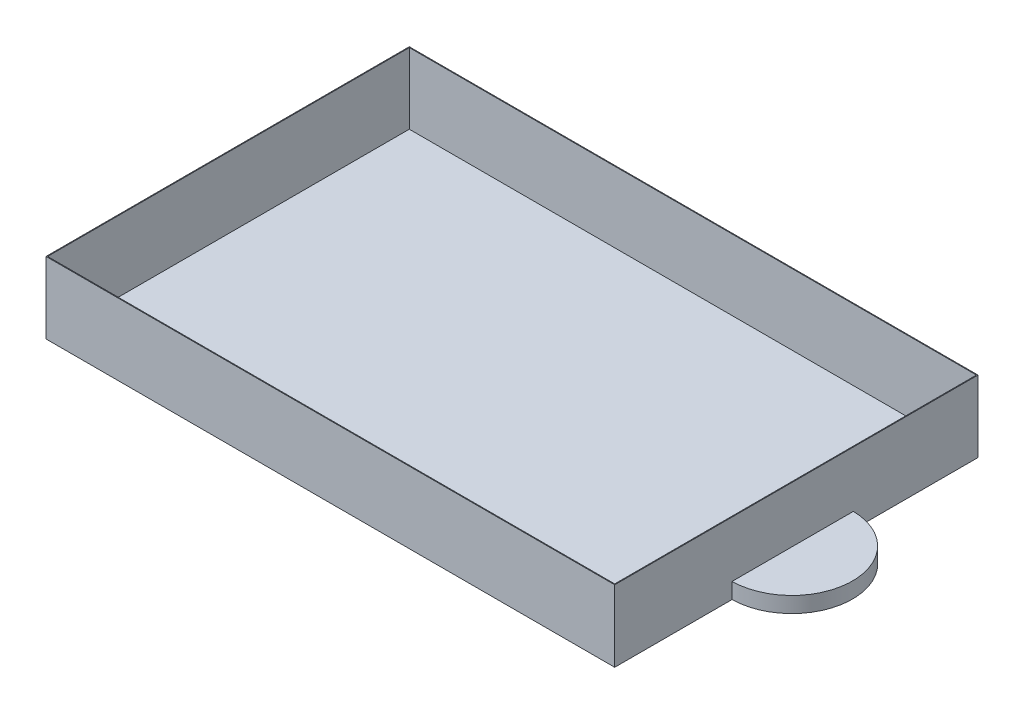
ISO-10303-21;
HEADER;
FILE_DESCRIPTION(('STEP AP214'),'2;1');
FILE_NAME('part.step','',(''),(''),'','','');
FILE_SCHEMA(('AUTOMOTIVE_DESIGN { 1 0 10303 214 1 1 1 1 }'));
ENDSEC;
DATA;
#1=APPLICATION_CONTEXT('core data for automotive mechanical design processes');
#2=APPLICATION_PROTOCOL_DEFINITION('international standard','automotive_design',2000,#1);
#3=PRODUCT_CONTEXT('',#1,'mechanical');
#4=PRODUCT('Part','Part','',(#3));
#5=PRODUCT_RELATED_PRODUCT_CATEGORY('part','',(#4));
#6=PRODUCT_DEFINITION_FORMATION('','',#4);
#7=PRODUCT_DEFINITION_CONTEXT('part definition',#1,'design');
#8=PRODUCT_DEFINITION('design','',#6,#7);
#9=PRODUCT_DEFINITION_SHAPE('','',#8);
#10=(LENGTH_UNIT() NAMED_UNIT(*) SI_UNIT(.MILLI.,.METRE.));
#11=(NAMED_UNIT(*) PLANE_ANGLE_UNIT() SI_UNIT($,.RADIAN.));
#12=(NAMED_UNIT(*) SI_UNIT($,.STERADIAN.) SOLID_ANGLE_UNIT());
#13=UNCERTAINTY_MEASURE_WITH_UNIT(LENGTH_MEASURE(1.E-05),#10,'distance_accuracy_value','');
#14=(GEOMETRIC_REPRESENTATION_CONTEXT(3) GLOBAL_UNCERTAINTY_ASSIGNED_CONTEXT((#13)) GLOBAL_UNIT_ASSIGNED_CONTEXT((#10,
#11,#12)) REPRESENTATION_CONTEXT('',''));
#15=CARTESIAN_POINT('',(0.,0.,0.));
#16=DIRECTION('',(0.,0.,1.));
#17=DIRECTION('',(1.,0.,0.));
#18=AXIS2_PLACEMENT_3D('',#15,#16,#17);
#19=CARTESIAN_POINT('',(72.4042738347161,9.1,0.));
#20=DIRECTION('',(-1.,0.,0.));
#21=DIRECTION('',(0.,0.,1.));
#22=AXIS2_PLACEMENT_3D('',#19,#20,#21);
#23=PLANE('',#22);
#24=DIRECTION('',(0.,-1.,0.));
#25=VECTOR('',#24,1.);
#26=CARTESIAN_POINT('',(72.4042738347161,2.,-30.3789905309977));
#27=LINE('',#26,#25);
#28=CARTESIAN_POINT('',(72.4042738347161,0.,-30.3789905309977));
#29=VERTEX_POINT('',#28);
#30=CARTESIAN_POINT('',(72.4042738347161,2.,-30.3789905309977));
#31=VERTEX_POINT('',#30);
#32=EDGE_CURVE('E131',#29,#31,#27,.F.);
#33=ORIENTED_EDGE('',*,*,#32,.F.);
#34=DIRECTION('',(0.,0.,-1.));
#35=VECTOR('',#34,1.);
#36=CARTESIAN_POINT('',(72.4042738347161,0.,0.));
#37=LINE('',#36,#35);
#38=CARTESIAN_POINT('',(72.4042738347161,0.,-46.2519188910528));
#39=VERTEX_POINT('',#38);
#40=EDGE_CURVE('E118',#29,#39,#37,.T.);
#41=ORIENTED_EDGE('',*,*,#40,.T.);
#42=DIRECTION('',(0.,-1.,0.));
#43=VECTOR('',#42,1.);
#44=CARTESIAN_POINT('',(72.4042738347161,9.1,-46.2519188910528));
#45=LINE('',#44,#43);
#46=CARTESIAN_POINT('',(72.4042738347161,9.1,-46.2519188910528));
#47=VERTEX_POINT('',#46);
#48=EDGE_CURVE('E216',#47,#39,#45,.T.);
#49=ORIENTED_EDGE('',*,*,#48,.F.);
#50=DIRECTION('',(0.,0.,-1.));
#51=VECTOR('',#50,1.);
#52=CARTESIAN_POINT('',(72.4042738347161,9.1,0.));
#53=LINE('',#52,#51);
#54=CARTESIAN_POINT('',(72.4042738347161,9.1,0.));
#55=VERTEX_POINT('',#54);
#56=EDGE_CURVE('E198',#55,#47,#53,.T.);
#57=ORIENTED_EDGE('',*,*,#56,.F.);
#58=DIRECTION('',(0.,-1.,0.));
#59=VECTOR('',#58,1.);
#60=CARTESIAN_POINT('',(72.4042738347161,9.1,0.));
#61=LINE('',#60,#59);
#62=CARTESIAN_POINT('',(72.4042738347161,0.,0.));
#63=VERTEX_POINT('',#62);
#64=EDGE_CURVE('E50',#55,#63,#61,.T.);
#65=ORIENTED_EDGE('',*,*,#64,.T.);
#66=CARTESIAN_POINT('',(72.4042738347161,0.,-14.937172772359));
#67=VERTEX_POINT('',#66);
#68=EDGE_CURVE('E128',#63,#67,#37,.T.);
#69=ORIENTED_EDGE('',*,*,#68,.T.);
#70=DIRECTION('',(0.,-1.,0.));
#71=VECTOR('',#70,1.);
#72=CARTESIAN_POINT('',(72.4042738347161,2.,-14.937172772359));
#73=LINE('',#72,#71);
#74=CARTESIAN_POINT('',(72.4042738347161,2.,-14.937172772359));
#75=VERTEX_POINT('',#74);
#76=EDGE_CURVE('E57',#75,#67,#73,.T.);
#77=ORIENTED_EDGE('',*,*,#76,.F.);
#78=DIRECTION('',(0.,0.,1.));
#79=VECTOR('',#78,1.);
#80=CARTESIAN_POINT('',(72.4042738347161,2.,0.));
#81=LINE('',#80,#79);
#82=EDGE_CURVE('E61',#31,#75,#81,.T.);
#83=ORIENTED_EDGE('',*,*,#82,.F.);
#84=EDGE_LOOP('',(#33,#41,#49,#57,#65,#69,#77,#83));
#85=FACE_BOUND('',#84,.T.);
#86=ADVANCED_FACE('F41',(#85),#23,.F.);
#87=CARTESIAN_POINT('',(0.,9.1,0.));
#88=DIRECTION('',(0.,-1.,0.));
#89=DIRECTION('',(0.,0.,-1.));
#90=AXIS2_PLACEMENT_3D('',#87,#88,#89);
#91=PLANE('',#90);
#92=DIRECTION('',(0.,0.,1.));
#93=VECTOR('',#92,1.);
#94=CARTESIAN_POINT('',(0.,9.1,0.));
#95=LINE('',#94,#93);
#96=CARTESIAN_POINT('',(0.,9.1,-46.2519188910528));
#97=VERTEX_POINT('',#96);
#98=CARTESIAN_POINT('',(0.,9.1,0.));
#99=VERTEX_POINT('',#98);
#100=EDGE_CURVE('E191',#97,#99,#95,.T.);
#101=ORIENTED_EDGE('',*,*,#100,.T.);
#102=DIRECTION('',(1.,0.,0.));
#103=VECTOR('',#102,1.);
#104=CARTESIAN_POINT('',(0.,9.1,0.));
#105=LINE('',#104,#103);
#106=EDGE_CURVE('E195',#99,#55,#105,.T.);
#107=ORIENTED_EDGE('',*,*,#106,.T.);
#108=ORIENTED_EDGE('',*,*,#56,.T.);
#109=DIRECTION('',(-1.,0.,0.));
#110=VECTOR('',#109,1.);
#111=CARTESIAN_POINT('',(0.,9.1,-46.2519188910528));
#112=LINE('',#111,#110);
#113=EDGE_CURVE('E201',#47,#97,#112,.T.);
#114=ORIENTED_EDGE('',*,*,#113,.T.);
#115=EDGE_LOOP('',(#101,#107,#108,#114));
#116=FACE_BOUND('',#115,.T.);
#117=DIRECTION('',(0.,0.,1.));
#118=VECTOR('',#117,1.);
#119=CARTESIAN_POINT('',(0.1,9.1,0.));
#120=LINE('',#119,#118);
#121=CARTESIAN_POINT('',(0.1,9.1,-46.1519188910528));
#122=VERTEX_POINT('',#121);
#123=CARTESIAN_POINT('',(0.1,9.1,-0.1));
#124=VERTEX_POINT('',#123);
#125=EDGE_CURVE('E179',#122,#124,#120,.T.);
#126=ORIENTED_EDGE('',*,*,#125,.F.);
#127=DIRECTION('',(-1.,0.,0.));
#128=VECTOR('',#127,1.);
#129=CARTESIAN_POINT('',(0.,9.1,-46.1519188910528));
#130=LINE('',#129,#128);
#131=CARTESIAN_POINT('',(72.3042738347161,9.1,-46.1519188910528));
#132=VERTEX_POINT('',#131);
#133=EDGE_CURVE('E164',#132,#122,#130,.T.);
#134=ORIENTED_EDGE('',*,*,#133,.F.);
#135=DIRECTION('',(0.,0.,-1.));
#136=VECTOR('',#135,1.);
#137=CARTESIAN_POINT('',(72.3042738347161,9.1,0.));
#138=LINE('',#137,#136);
#139=CARTESIAN_POINT('',(72.3042738347161,9.1,-0.1));
#140=VERTEX_POINT('',#139);
#141=EDGE_CURVE('E185',#140,#132,#138,.T.);
#142=ORIENTED_EDGE('',*,*,#141,.F.);
#143=DIRECTION('',(1.,0.,0.));
#144=VECTOR('',#143,1.);
#145=CARTESIAN_POINT('',(0.,9.1,-0.1));
#146=LINE('',#145,#144);
#147=EDGE_CURVE('E182',#124,#140,#146,.T.);
#148=ORIENTED_EDGE('',*,*,#147,.F.);
#149=EDGE_LOOP('',(#126,#134,#142,#148));
#150=FACE_BOUND('',#149,.T.);
#151=ADVANCED_FACE('F232',(#116,#150),#91,.F.);
#152=CARTESIAN_POINT('',(0.,9.1,0.));
#153=DIRECTION('',(1.,0.,0.));
#154=DIRECTION('',(0.,0.,-1.));
#155=AXIS2_PLACEMENT_3D('',#152,#153,#154);
#156=PLANE('',#155);
#157=DIRECTION('',(0.,0.,1.));
#158=VECTOR('',#157,1.);
#159=CARTESIAN_POINT('',(0.,0.,0.));
#160=LINE('',#159,#158);
#161=CARTESIAN_POINT('',(0.,0.,-46.2519188910528));
#162=VERTEX_POINT('',#161);
#163=CARTESIAN_POINT('',(0.,0.,0.));
#164=VERTEX_POINT('',#163);
#165=EDGE_CURVE('E157',#162,#164,#160,.T.);
#166=ORIENTED_EDGE('',*,*,#165,.T.);
#167=DIRECTION('',(0.,-1.,0.));
#168=VECTOR('',#167,1.);
#169=CARTESIAN_POINT('',(0.,9.1,0.));
#170=LINE('',#169,#168);
#171=EDGE_CURVE('E11',#99,#164,#170,.T.);
#172=ORIENTED_EDGE('',*,*,#171,.F.);
#173=ORIENTED_EDGE('',*,*,#100,.F.);
#174=DIRECTION('',(0.,-1.,0.));
#175=VECTOR('',#174,1.);
#176=CARTESIAN_POINT('',(0.,9.1,-46.2519188910528));
#177=LINE('',#176,#175);
#178=EDGE_CURVE('E204',#97,#162,#177,.T.);
#179=ORIENTED_EDGE('',*,*,#178,.T.);
#180=EDGE_LOOP('',(#166,#172,#173,#179));
#181=FACE_BOUND('',#180,.T.);
#182=ADVANCED_FACE('F43',(#181),#156,.F.);
#183=CARTESIAN_POINT('',(0.,9.1,0.));
#184=DIRECTION('',(0.,0.,-1.));
#185=DIRECTION('',(-1.,0.,0.));
#186=AXIS2_PLACEMENT_3D('',#183,#184,#185);
#187=PLANE('',#186);
#188=DIRECTION('',(1.,0.,0.));
#189=VECTOR('',#188,1.);
#190=CARTESIAN_POINT('',(0.,0.,0.));
#191=LINE('',#190,#189);
#192=EDGE_CURVE('E129',#164,#63,#191,.T.);
#193=ORIENTED_EDGE('',*,*,#192,.T.);
#194=ORIENTED_EDGE('',*,*,#64,.F.);
#195=ORIENTED_EDGE('',*,*,#106,.F.);
#196=ORIENTED_EDGE('',*,*,#171,.T.);
#197=EDGE_LOOP('',(#193,#194,#195,#196));
#198=FACE_BOUND('',#197,.T.);
#199=ADVANCED_FACE('F224',(#198),#187,.F.);
#200=CARTESIAN_POINT('',(0.,9.1,-46.2519188910528));
#201=DIRECTION('',(0.,0.,1.));
#202=DIRECTION('',(1.,0.,0.));
#203=AXIS2_PLACEMENT_3D('',#200,#201,#202);
#204=PLANE('',#203);
#205=DIRECTION('',(-1.,0.,0.));
#206=VECTOR('',#205,1.);
#207=CARTESIAN_POINT('',(0.,0.,-46.2519188910528));
#208=LINE('',#207,#206);
#209=EDGE_CURVE('E124',#39,#162,#208,.T.);
#210=ORIENTED_EDGE('',*,*,#209,.T.);
#211=ORIENTED_EDGE('',*,*,#178,.F.);
#212=ORIENTED_EDGE('',*,*,#113,.F.);
#213=ORIENTED_EDGE('',*,*,#48,.T.);
#214=EDGE_LOOP('',(#210,#211,#212,#213));
#215=FACE_BOUND('',#214,.T.);
#216=ADVANCED_FACE('F230',(#215),#204,.F.);
#217=CARTESIAN_POINT('',(0.,0.,0.));
#218=DIRECTION('',(0.,-1.,0.));
#219=DIRECTION('',(0.,0.,-1.));
#220=AXIS2_PLACEMENT_3D('',#217,#218,#219);
#221=PLANE('',#220);
#222=ORIENTED_EDGE('',*,*,#40,.F.);
#223=CARTESIAN_POINT('',(72.3042738347161,0.,-22.6580816516783));
#224=DIRECTION('',(0.,1.,0.));
#225=DIRECTION('',(0.,0.,-1.));
#226=AXIS2_PLACEMENT_3D('',#223,#224,#225);
#227=CIRCLE('',#226,7.72155644431564);
#228=EDGE_CURVE('E122',#67,#29,#227,.T.);
#229=ORIENTED_EDGE('',*,*,#228,.F.);
#230=ORIENTED_EDGE('',*,*,#68,.F.);
#231=ORIENTED_EDGE('',*,*,#192,.F.);
#232=ORIENTED_EDGE('',*,*,#165,.F.);
#233=ORIENTED_EDGE('',*,*,#209,.F.);
#234=EDGE_LOOP('',(#222,#229,#230,#231,#232,#233));
#235=FACE_BOUND('',#234,.T.);
#236=ADVANCED_FACE('F119',(#235),#221,.T.);
#237=CARTESIAN_POINT('',(0.1,9.1,0.));
#238=DIRECTION('',(1.,0.,0.));
#239=DIRECTION('',(0.,0.,-1.));
#240=AXIS2_PLACEMENT_3D('',#237,#238,#239);
#241=PLANE('',#240);
#242=DIRECTION('',(0.,0.,1.));
#243=VECTOR('',#242,1.);
#244=CARTESIAN_POINT('',(0.1,0.1,0.));
#245=LINE('',#244,#243);
#246=CARTESIAN_POINT('',(0.1,0.1,-46.1519188910528));
#247=VERTEX_POINT('',#246);
#248=CARTESIAN_POINT('',(0.1,0.1,-0.1));
#249=VERTEX_POINT('',#248);
#250=EDGE_CURVE('E148',#247,#249,#245,.T.);
#251=ORIENTED_EDGE('',*,*,#250,.F.);
#252=DIRECTION('',(0.,-1.,0.));
#253=VECTOR('',#252,1.);
#254=CARTESIAN_POINT('',(0.1,9.1,-46.1519188910528));
#255=LINE('',#254,#253);
#256=EDGE_CURVE('E159',#122,#247,#255,.T.);
#257=ORIENTED_EDGE('',*,*,#256,.F.);
#258=ORIENTED_EDGE('',*,*,#125,.T.);
#259=DIRECTION('',(0.,-1.,0.));
#260=VECTOR('',#259,1.);
#261=CARTESIAN_POINT('',(0.1,9.1,-0.1));
#262=LINE('',#261,#260);
#263=EDGE_CURVE('E153',#124,#249,#262,.T.);
#264=ORIENTED_EDGE('',*,*,#263,.T.);
#265=EDGE_LOOP('',(#251,#257,#258,#264));
#266=FACE_BOUND('',#265,.T.);
#267=ADVANCED_FACE('F244',(#266),#241,.T.);
#268=CARTESIAN_POINT('',(0.,9.1,-0.1));
#269=DIRECTION('',(0.,0.,-1.));
#270=DIRECTION('',(-1.,0.,0.));
#271=AXIS2_PLACEMENT_3D('',#268,#269,#270);
#272=PLANE('',#271);
#273=DIRECTION('',(1.,0.,0.));
#274=VECTOR('',#273,1.);
#275=CARTESIAN_POINT('',(0.,0.1,-0.1));
#276=LINE('',#275,#274);
#277=CARTESIAN_POINT('',(72.3042738347161,0.1,-0.1));
#278=VERTEX_POINT('',#277);
#279=EDGE_CURVE('E152',#249,#278,#276,.T.);
#280=ORIENTED_EDGE('',*,*,#279,.F.);
#281=ORIENTED_EDGE('',*,*,#263,.F.);
#282=ORIENTED_EDGE('',*,*,#147,.T.);
#283=DIRECTION('',(0.,-1.,0.));
#284=VECTOR('',#283,1.);
#285=CARTESIAN_POINT('',(72.3042738347161,9.1,-0.1));
#286=LINE('',#285,#284);
#287=EDGE_CURVE('E158',#140,#278,#286,.T.);
#288=ORIENTED_EDGE('',*,*,#287,.T.);
#289=EDGE_LOOP('',(#280,#281,#282,#288));
#290=FACE_BOUND('',#289,.T.);
#291=ADVANCED_FACE('F246',(#290),#272,.T.);
#292=CARTESIAN_POINT('',(72.3042738347161,9.1,0.));
#293=DIRECTION('',(-1.,0.,0.));
#294=DIRECTION('',(0.,0.,1.));
#295=AXIS2_PLACEMENT_3D('',#292,#293,#294);
#296=PLANE('',#295);
#297=DIRECTION('',(0.,-1.,0.));
#298=VECTOR('',#297,1.);
#299=CARTESIAN_POINT('',(72.3042738347161,9.1,-46.1519188910528));
#300=LINE('',#299,#298);
#301=CARTESIAN_POINT('',(72.3042738347161,0.1,-46.1519188910528));
#302=VERTEX_POINT('',#301);
#303=EDGE_CURVE('E163',#132,#302,#300,.T.);
#304=ORIENTED_EDGE('',*,*,#303,.T.);
#305=DIRECTION('',(0.,0.,-1.));
#306=VECTOR('',#305,1.);
#307=CARTESIAN_POINT('',(72.3042738347161,0.1,0.));
#308=LINE('',#307,#306);
#309=EDGE_CURVE('E167',#278,#302,#308,.T.);
#310=ORIENTED_EDGE('',*,*,#309,.F.);
#311=ORIENTED_EDGE('',*,*,#287,.F.);
#312=ORIENTED_EDGE('',*,*,#141,.T.);
#313=EDGE_LOOP('',(#304,#310,#311,#312));
#314=FACE_BOUND('',#313,.T.);
#315=ADVANCED_FACE('F255',(#314),#296,.T.);
#316=CARTESIAN_POINT('',(0.,9.1,-46.1519188910528));
#317=DIRECTION('',(0.,0.,1.));
#318=DIRECTION('',(1.,0.,0.));
#319=AXIS2_PLACEMENT_3D('',#316,#317,#318);
#320=PLANE('',#319);
#321=DIRECTION('',(-1.,0.,0.));
#322=VECTOR('',#321,1.);
#323=CARTESIAN_POINT('',(0.,0.1,-46.1519188910528));
#324=LINE('',#323,#322);
#325=EDGE_CURVE('E173',#302,#247,#324,.T.);
#326=ORIENTED_EDGE('',*,*,#325,.F.);
#327=ORIENTED_EDGE('',*,*,#303,.F.);
#328=ORIENTED_EDGE('',*,*,#133,.T.);
#329=ORIENTED_EDGE('',*,*,#256,.T.);
#330=EDGE_LOOP('',(#326,#327,#328,#329));
#331=FACE_BOUND('',#330,.T.);
#332=ADVANCED_FACE('F253',(#331),#320,.T.);
#333=CARTESIAN_POINT('',(0.,0.1,0.));
#334=DIRECTION('',(0.,-1.,0.));
#335=DIRECTION('',(0.,0.,-1.));
#336=AXIS2_PLACEMENT_3D('',#333,#334,#335);
#337=PLANE('',#336);
#338=ORIENTED_EDGE('',*,*,#250,.T.);
#339=ORIENTED_EDGE('',*,*,#279,.T.);
#340=ORIENTED_EDGE('',*,*,#309,.T.);
#341=ORIENTED_EDGE('',*,*,#325,.T.);
#342=EDGE_LOOP('',(#338,#339,#340,#341));
#343=FACE_BOUND('',#342,.T.);
#344=ADVANCED_FACE('F250',(#343),#337,.F.);
#345=CARTESIAN_POINT('',(72.3042738347161,2.,-22.6580816516783));
#346=DIRECTION('',(0.,-1.,0.));
#347=DIRECTION('',(0.,0.,-1.));
#348=AXIS2_PLACEMENT_3D('',#345,#346,#347);
#349=PLANE('',#348);
#350=CARTESIAN_POINT('',(72.3042738347161,2.,-22.6580816516783));
#351=DIRECTION('',(0.,1.,0.));
#352=DIRECTION('',(0.,0.,-1.));
#353=AXIS2_PLACEMENT_3D('',#350,#351,#352);
#354=CIRCLE('',#353,7.72155644431564);
#355=EDGE_CURVE('E139',#75,#31,#354,.T.);
#356=ORIENTED_EDGE('',*,*,#355,.T.);
#357=ORIENTED_EDGE('',*,*,#82,.T.);
#358=EDGE_LOOP('',(#356,#357));
#359=FACE_BOUND('',#358,.T.);
#360=ADVANCED_FACE('F335',(#359),#349,.F.);
#361=CARTESIAN_POINT('',(72.3042738347161,2.,-22.6580816516783));
#362=DIRECTION('',(0.,-1.,0.));
#363=DIRECTION('',(0.,0.,-1.));
#364=AXIS2_PLACEMENT_3D('',#361,#362,#363);
#365=CYLINDRICAL_SURFACE('',#364,7.72155644431564);
#366=ORIENTED_EDGE('',*,*,#228,.T.);
#367=ORIENTED_EDGE('',*,*,#32,.T.);
#368=ORIENTED_EDGE('',*,*,#355,.F.);
#369=ORIENTED_EDGE('',*,*,#76,.T.);
#370=EDGE_LOOP('',(#366,#367,#368,#369));
#371=FACE_BOUND('',#370,.T.);
#372=ADVANCED_FACE('F137',(#371),#365,.T.);
#373=CLOSED_SHELL('',(#86,#151,#182,#199,#216,#236,#267,#291,#315,#332,#344,#360,#372));
#374=MANIFOLD_SOLID_BREP('B2',#373);
#375=ADVANCED_BREP_SHAPE_REPRESENTATION('',(#18,#374),#14);
#376=SHAPE_DEFINITION_REPRESENTATION(#9,#375);
ENDSEC;
END-ISO-10303-21;
